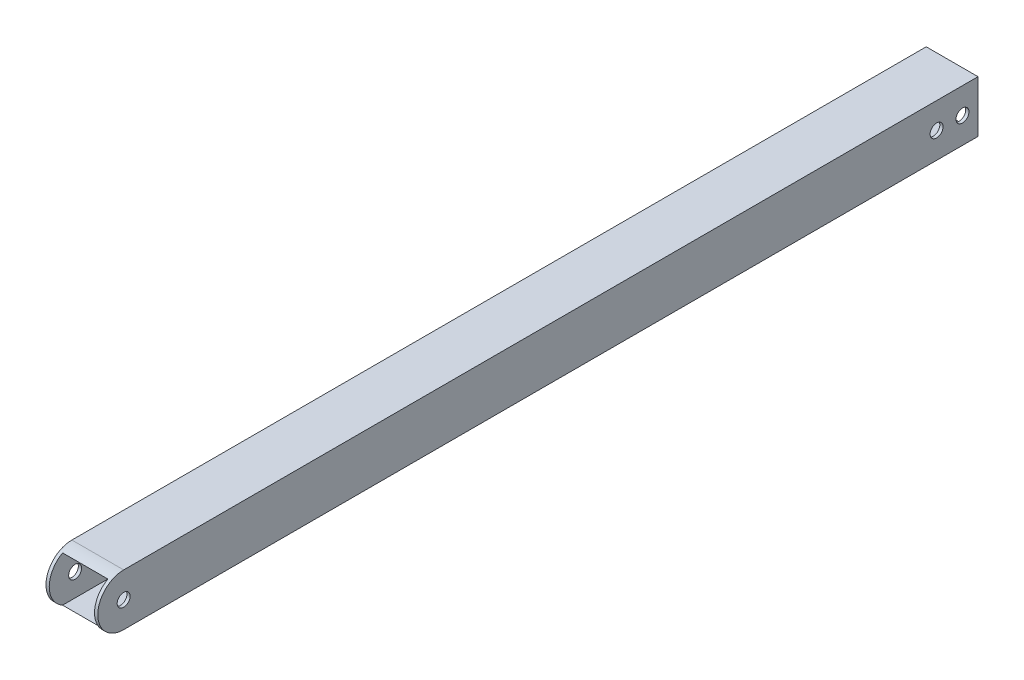
ISO-10303-21;
HEADER;
FILE_DESCRIPTION(('STEP AP214'),'2;1');
FILE_NAME('part.step','',(''),(''),'','','');
FILE_SCHEMA(('AUTOMOTIVE_DESIGN { 1 0 10303 214 1 1 1 1 }'));
ENDSEC;
DATA;
#1=APPLICATION_CONTEXT('core data for automotive mechanical design processes');
#2=APPLICATION_PROTOCOL_DEFINITION('international standard','automotive_design',2000,#1);
#3=PRODUCT_CONTEXT('',#1,'mechanical');
#4=PRODUCT('Part','Part','',(#3));
#5=PRODUCT_RELATED_PRODUCT_CATEGORY('part','',(#4));
#6=PRODUCT_DEFINITION_FORMATION('','',#4);
#7=PRODUCT_DEFINITION_CONTEXT('part definition',#1,'design');
#8=PRODUCT_DEFINITION('design','',#6,#7);
#9=PRODUCT_DEFINITION_SHAPE('','',#8);
#10=(LENGTH_UNIT() NAMED_UNIT(*) SI_UNIT(.MILLI.,.METRE.));
#11=(NAMED_UNIT(*) PLANE_ANGLE_UNIT() SI_UNIT($,.RADIAN.));
#12=(NAMED_UNIT(*) SI_UNIT($,.STERADIAN.) SOLID_ANGLE_UNIT());
#13=UNCERTAINTY_MEASURE_WITH_UNIT(LENGTH_MEASURE(1.E-05),#10,'distance_accuracy_value','');
#14=(GEOMETRIC_REPRESENTATION_CONTEXT(3) GLOBAL_UNCERTAINTY_ASSIGNED_CONTEXT((#13)) GLOBAL_UNIT_ASSIGNED_CONTEXT((#10,
#11,#12)) REPRESENTATION_CONTEXT('',''));
#15=CARTESIAN_POINT('',(0.,0.,0.));
#16=DIRECTION('',(0.,0.,1.));
#17=DIRECTION('',(1.,0.,0.));
#18=AXIS2_PLACEMENT_3D('',#15,#16,#17);
#19=CARTESIAN_POINT('',(12.7,12.7,431.8));
#20=DIRECTION('',(-1.,0.,0.));
#21=DIRECTION('',(0.,-1.,0.));
#22=AXIS2_PLACEMENT_3D('',#19,#20,#21);
#23=PLANE('',#22);
#24=CARTESIAN_POINT('',(12.7,0.,419.1));
#25=DIRECTION('',(1.,0.,0.));
#26=DIRECTION('',(0.,1.,0.));
#27=AXIS2_PLACEMENT_3D('',#24,#25,#26);
#28=CIRCLE('',#27,3.17499999999997);
#29=CARTESIAN_POINT('',(12.7,3.17499999999997,419.1));
#30=VERTEX_POINT('',#29);
#31=EDGE_CURVE('E205',#30,#30,#28,.T.);
#32=ORIENTED_EDGE('',*,*,#31,.F.);
#33=EDGE_LOOP('',(#32));
#34=FACE_BOUND('',#33,.T.);
#35=CARTESIAN_POINT('',(12.7,0.,7.62));
#36=DIRECTION('',(1.,0.,0.));
#37=DIRECTION('',(0.,1.,0.));
#38=AXIS2_PLACEMENT_3D('',#35,#36,#37);
#39=CIRCLE('',#38,3.175);
#40=CARTESIAN_POINT('',(12.7,3.175,7.62));
#41=VERTEX_POINT('',#40);
#42=EDGE_CURVE('E211',#41,#41,#39,.T.);
#43=ORIENTED_EDGE('',*,*,#42,.F.);
#44=EDGE_LOOP('',(#43));
#45=FACE_BOUND('',#44,.T.);
#46=CARTESIAN_POINT('',(12.7,0.,20.32));
#47=DIRECTION('',(1.,0.,0.));
#48=DIRECTION('',(0.,1.,0.));
#49=AXIS2_PLACEMENT_3D('',#46,#47,#48);
#50=CIRCLE('',#49,3.175);
#51=CARTESIAN_POINT('',(12.7,3.175,20.32));
#52=VERTEX_POINT('',#51);
#53=EDGE_CURVE('E202',#52,#52,#50,.T.);
#54=ORIENTED_EDGE('',*,*,#53,.F.);
#55=EDGE_LOOP('',(#54));
#56=FACE_BOUND('',#55,.T.);
#57=CARTESIAN_POINT('',(12.7,0.,419.1));
#58=DIRECTION('',(1.,0.,0.));
#59=DIRECTION('',(0.,1.,0.));
#60=AXIS2_PLACEMENT_3D('',#57,#58,#59);
#61=CIRCLE('',#60,12.7);
#62=CARTESIAN_POINT('',(12.7,12.7,419.1));
#63=VERTEX_POINT('',#62);
#64=CARTESIAN_POINT('',(12.7,-12.7,419.1));
#65=VERTEX_POINT('',#64);
#66=EDGE_CURVE('E116',#63,#65,#61,.T.);
#67=ORIENTED_EDGE('',*,*,#66,.T.);
#68=DIRECTION('',(0.,0.,-1.));
#69=VECTOR('',#68,1.);
#70=CARTESIAN_POINT('',(12.7,-12.7,431.8));
#71=LINE('',#70,#69);
#72=CARTESIAN_POINT('',(12.7,-12.7,0.));
#73=VERTEX_POINT('',#72);
#74=EDGE_CURVE('E120',#65,#73,#71,.T.);
#75=ORIENTED_EDGE('',*,*,#74,.T.);
#76=DIRECTION('',(0.,1.,0.));
#77=VECTOR('',#76,1.);
#78=CARTESIAN_POINT('',(12.7,12.7,0.));
#79=LINE('',#78,#77);
#80=CARTESIAN_POINT('',(12.7,12.7,0.));
#81=VERTEX_POINT('',#80);
#82=EDGE_CURVE('E181',#73,#81,#79,.T.);
#83=ORIENTED_EDGE('',*,*,#82,.T.);
#84=DIRECTION('',(0.,0.,-1.));
#85=VECTOR('',#84,1.);
#86=CARTESIAN_POINT('',(12.7,12.7,431.8));
#87=LINE('',#86,#85);
#88=EDGE_CURVE('E122',#63,#81,#87,.T.);
#89=ORIENTED_EDGE('',*,*,#88,.F.);
#90=EDGE_LOOP('',(#67,#75,#83,#89));
#91=FACE_BOUND('',#90,.T.);
#92=ADVANCED_FACE('F52',(#34,#45,#56,#91),#23,.F.);
#93=CARTESIAN_POINT('',(-12.7,12.7,431.8));
#94=DIRECTION('',(1.,0.,0.));
#95=DIRECTION('',(0.,1.,0.));
#96=AXIS2_PLACEMENT_3D('',#93,#94,#95);
#97=PLANE('',#96);
#98=CARTESIAN_POINT('',(-12.7,0.,419.1));
#99=DIRECTION('',(1.,0.,0.));
#100=DIRECTION('',(0.,1.,0.));
#101=AXIS2_PLACEMENT_3D('',#98,#99,#100);
#102=CIRCLE('',#101,3.17499999999997);
#103=CARTESIAN_POINT('',(-12.7,3.17499999999997,419.1));
#104=VERTEX_POINT('',#103);
#105=EDGE_CURVE('E153',#104,#104,#102,.T.);
#106=ORIENTED_EDGE('',*,*,#105,.T.);
#107=EDGE_LOOP('',(#106));
#108=FACE_BOUND('',#107,.T.);
#109=CARTESIAN_POINT('',(-12.7,0.,7.62));
#110=DIRECTION('',(1.,0.,0.));
#111=DIRECTION('',(0.,1.,0.));
#112=AXIS2_PLACEMENT_3D('',#109,#110,#111);
#113=CIRCLE('',#112,3.175);
#114=CARTESIAN_POINT('',(-12.7,3.175,7.62));
#115=VERTEX_POINT('',#114);
#116=EDGE_CURVE('E208',#115,#115,#113,.T.);
#117=ORIENTED_EDGE('',*,*,#116,.T.);
#118=EDGE_LOOP('',(#117));
#119=FACE_BOUND('',#118,.T.);
#120=CARTESIAN_POINT('',(-12.7,0.,20.32));
#121=DIRECTION('',(1.,0.,0.));
#122=DIRECTION('',(0.,1.,0.));
#123=AXIS2_PLACEMENT_3D('',#120,#121,#122);
#124=CIRCLE('',#123,3.175);
#125=CARTESIAN_POINT('',(-12.7,3.175,20.32));
#126=VERTEX_POINT('',#125);
#127=EDGE_CURVE('E214',#126,#126,#124,.T.);
#128=ORIENTED_EDGE('',*,*,#127,.T.);
#129=EDGE_LOOP('',(#128));
#130=FACE_BOUND('',#129,.T.);
#131=DIRECTION('',(0.,0.,-1.));
#132=VECTOR('',#131,1.);
#133=CARTESIAN_POINT('',(-12.7,-12.7,431.8));
#134=LINE('',#133,#132);
#135=CARTESIAN_POINT('',(-12.7000000000002,-12.7,419.1));
#136=VERTEX_POINT('',#135);
#137=CARTESIAN_POINT('',(-12.7,-12.7,0.));
#138=VERTEX_POINT('',#137);
#139=EDGE_CURVE('E139',#136,#138,#134,.T.);
#140=ORIENTED_EDGE('',*,*,#139,.F.);
#141=CARTESIAN_POINT('',(-12.7,0.,419.1));
#142=DIRECTION('',(1.,0.,0.));
#143=DIRECTION('',(0.,1.,0.));
#144=AXIS2_PLACEMENT_3D('',#141,#142,#143);
#145=CIRCLE('',#144,12.7);
#146=CARTESIAN_POINT('',(-12.7000000000001,12.7,419.1));
#147=VERTEX_POINT('',#146);
#148=EDGE_CURVE('E131',#147,#136,#145,.T.);
#149=ORIENTED_EDGE('',*,*,#148,.F.);
#150=DIRECTION('',(0.,0.,-1.));
#151=VECTOR('',#150,1.);
#152=CARTESIAN_POINT('',(-12.7,12.7,431.8));
#153=LINE('',#152,#151);
#154=CARTESIAN_POINT('',(-12.7,12.7,0.));
#155=VERTEX_POINT('',#154);
#156=EDGE_CURVE('E141',#147,#155,#153,.T.);
#157=ORIENTED_EDGE('',*,*,#156,.T.);
#158=DIRECTION('',(0.,-1.,0.));
#159=VECTOR('',#158,1.);
#160=CARTESIAN_POINT('',(-12.7,12.7,0.));
#161=LINE('',#160,#159);
#162=EDGE_CURVE('E143',#155,#138,#161,.T.);
#163=ORIENTED_EDGE('',*,*,#162,.T.);
#164=EDGE_LOOP('',(#140,#149,#157,#163));
#165=FACE_BOUND('',#164,.T.);
#166=ADVANCED_FACE('F188',(#108,#119,#130,#165),#97,.F.);
#167=CARTESIAN_POINT('',(-11.1125,11.1125,431.8));
#168=DIRECTION('',(1.,0.,0.));
#169=DIRECTION('',(0.,1.,0.));
#170=AXIS2_PLACEMENT_3D('',#167,#168,#169);
#171=PLANE('',#170);
#172=CARTESIAN_POINT('',(-11.1125,0.,419.1));
#173=DIRECTION('',(1.,0.,0.));
#174=DIRECTION('',(0.,1.,0.));
#175=AXIS2_PLACEMENT_3D('',#172,#173,#174);
#176=CIRCLE('',#175,3.17499999999997);
#177=CARTESIAN_POINT('',(-11.1125,3.17499999999997,419.1));
#178=VERTEX_POINT('',#177);
#179=EDGE_CURVE('E160',#178,#178,#176,.T.);
#180=ORIENTED_EDGE('',*,*,#179,.F.);
#181=EDGE_LOOP('',(#180));
#182=FACE_BOUND('',#181,.T.);
#183=CARTESIAN_POINT('',(-11.1125,0.,7.62));
#184=DIRECTION('',(1.,0.,0.));
#185=DIRECTION('',(0.,1.,0.));
#186=AXIS2_PLACEMENT_3D('',#183,#184,#185);
#187=CIRCLE('',#186,3.175);
#188=CARTESIAN_POINT('',(-11.1125,3.175,7.62));
#189=VERTEX_POINT('',#188);
#190=EDGE_CURVE('E157',#189,#189,#187,.T.);
#191=ORIENTED_EDGE('',*,*,#190,.F.);
#192=EDGE_LOOP('',(#191));
#193=FACE_BOUND('',#192,.T.);
#194=CARTESIAN_POINT('',(-11.1125,0.,20.32));
#195=DIRECTION('',(1.,0.,0.));
#196=DIRECTION('',(0.,1.,0.));
#197=AXIS2_PLACEMENT_3D('',#194,#195,#196);
#198=CIRCLE('',#197,3.175);
#199=CARTESIAN_POINT('',(-11.1125,3.175,20.32));
#200=VERTEX_POINT('',#199);
#201=EDGE_CURVE('E152',#200,#200,#198,.T.);
#202=ORIENTED_EDGE('',*,*,#201,.F.);
#203=EDGE_LOOP('',(#202));
#204=FACE_BOUND('',#203,.T.);
#205=CARTESIAN_POINT('',(-11.1125,0.,419.1));
#206=DIRECTION('',(1.,0.,0.));
#207=DIRECTION('',(0.,1.,0.));
#208=AXIS2_PLACEMENT_3D('',#205,#206,#207);
#209=CIRCLE('',#208,12.7);
#210=CARTESIAN_POINT('',(-11.1125,11.1125,425.248361062104));
#211=VERTEX_POINT('',#210);
#212=CARTESIAN_POINT('',(-11.1125,-11.1124999999999,425.248361062104));
#213=VERTEX_POINT('',#212);
#214=EDGE_CURVE('E66',#211,#213,#209,.T.);
#215=ORIENTED_EDGE('',*,*,#214,.T.);
#216=DIRECTION('',(0.,0.,-1.));
#217=VECTOR('',#216,1.);
#218=CARTESIAN_POINT('',(-11.1125,-11.1125,431.8));
#219=LINE('',#218,#217);
#220=CARTESIAN_POINT('',(-11.1125,-11.1125,0.));
#221=VERTEX_POINT('',#220);
#222=EDGE_CURVE('E179',#213,#221,#219,.T.);
#223=ORIENTED_EDGE('',*,*,#222,.T.);
#224=DIRECTION('',(0.,-1.,0.));
#225=VECTOR('',#224,1.);
#226=CARTESIAN_POINT('',(-11.1125,11.1125,0.));
#227=LINE('',#226,#225);
#228=CARTESIAN_POINT('',(-11.1125,11.1125,0.));
#229=VERTEX_POINT('',#228);
#230=EDGE_CURVE('E168',#229,#221,#227,.T.);
#231=ORIENTED_EDGE('',*,*,#230,.F.);
#232=DIRECTION('',(0.,0.,-1.));
#233=VECTOR('',#232,1.);
#234=CARTESIAN_POINT('',(-11.1125,11.1125,431.8));
#235=LINE('',#234,#233);
#236=EDGE_CURVE('E73',#211,#229,#235,.T.);
#237=ORIENTED_EDGE('',*,*,#236,.F.);
#238=EDGE_LOOP('',(#215,#223,#231,#237));
#239=FACE_BOUND('',#238,.T.);
#240=ADVANCED_FACE('F166',(#182,#193,#204,#239),#171,.T.);
#241=CARTESIAN_POINT('',(11.1125,11.1125,431.8));
#242=DIRECTION('',(-1.,0.,0.));
#243=DIRECTION('',(0.,-1.,0.));
#244=AXIS2_PLACEMENT_3D('',#241,#242,#243);
#245=PLANE('',#244);
#246=CARTESIAN_POINT('',(11.1125,0.,419.1));
#247=DIRECTION('',(-1.,0.,0.));
#248=DIRECTION('',(0.,-1.,0.));
#249=AXIS2_PLACEMENT_3D('',#246,#247,#248);
#250=CIRCLE('',#249,3.17499999999997);
#251=CARTESIAN_POINT('',(11.1125,-3.17499999999997,419.1));
#252=VERTEX_POINT('',#251);
#253=EDGE_CURVE('E158',#252,#252,#250,.T.);
#254=ORIENTED_EDGE('',*,*,#253,.F.);
#255=EDGE_LOOP('',(#254));
#256=FACE_BOUND('',#255,.T.);
#257=CARTESIAN_POINT('',(11.1125,0.,7.62));
#258=DIRECTION('',(-1.,0.,0.));
#259=DIRECTION('',(0.,-1.,0.));
#260=AXIS2_PLACEMENT_3D('',#257,#258,#259);
#261=CIRCLE('',#260,3.175);
#262=CARTESIAN_POINT('',(11.1125,-3.175,7.62));
#263=VERTEX_POINT('',#262);
#264=EDGE_CURVE('E154',#263,#263,#261,.T.);
#265=ORIENTED_EDGE('',*,*,#264,.F.);
#266=EDGE_LOOP('',(#265));
#267=FACE_BOUND('',#266,.T.);
#268=CARTESIAN_POINT('',(11.1125,0.,20.32));
#269=DIRECTION('',(-1.,0.,0.));
#270=DIRECTION('',(0.,-1.,0.));
#271=AXIS2_PLACEMENT_3D('',#268,#269,#270);
#272=CIRCLE('',#271,3.175);
#273=CARTESIAN_POINT('',(11.1125,-3.175,20.32));
#274=VERTEX_POINT('',#273);
#275=EDGE_CURVE('E149',#274,#274,#272,.T.);
#276=ORIENTED_EDGE('',*,*,#275,.F.);
#277=EDGE_LOOP('',(#276));
#278=FACE_BOUND('',#277,.T.);
#279=DIRECTION('',(0.,0.,-1.));
#280=VECTOR('',#279,1.);
#281=CARTESIAN_POINT('',(11.1125,-11.1125,431.8));
#282=LINE('',#281,#280);
#283=CARTESIAN_POINT('',(11.1125,-11.1124999999999,425.248361062104));
#284=VERTEX_POINT('',#283);
#285=CARTESIAN_POINT('',(11.1125,-11.1125,0.));
#286=VERTEX_POINT('',#285);
#287=EDGE_CURVE('E172',#284,#286,#282,.T.);
#288=ORIENTED_EDGE('',*,*,#287,.F.);
#289=CARTESIAN_POINT('',(11.1125,0.,419.1));
#290=DIRECTION('',(-1.,0.,0.));
#291=DIRECTION('',(0.,-1.,0.));
#292=AXIS2_PLACEMENT_3D('',#289,#290,#291);
#293=CIRCLE('',#292,12.7);
#294=CARTESIAN_POINT('',(11.1125,11.1125000000001,425.248361062104));
#295=VERTEX_POINT('',#294);
#296=EDGE_CURVE('E196',#284,#295,#293,.T.);
#297=ORIENTED_EDGE('',*,*,#296,.T.);
#298=DIRECTION('',(0.,0.,-1.));
#299=VECTOR('',#298,1.);
#300=CARTESIAN_POINT('',(11.1125,11.1125,431.8));
#301=LINE('',#300,#299);
#302=CARTESIAN_POINT('',(11.1125,11.1125,0.));
#303=VERTEX_POINT('',#302);
#304=EDGE_CURVE('E163',#295,#303,#301,.T.);
#305=ORIENTED_EDGE('',*,*,#304,.T.);
#306=DIRECTION('',(0.,1.,0.));
#307=VECTOR('',#306,1.);
#308=CARTESIAN_POINT('',(11.1125,11.1125,0.));
#309=LINE('',#308,#307);
#310=EDGE_CURVE('E174',#286,#303,#309,.T.);
#311=ORIENTED_EDGE('',*,*,#310,.F.);
#312=EDGE_LOOP('',(#288,#297,#305,#311));
#313=FACE_BOUND('',#312,.T.);
#314=ADVANCED_FACE('F233',(#256,#267,#278,#313),#245,.T.);
#315=CARTESIAN_POINT('',(-12.7,-12.7,431.8));
#316=DIRECTION('',(0.,1.,0.));
#317=DIRECTION('',(0.,0.,1.));
#318=AXIS2_PLACEMENT_3D('',#315,#316,#317);
#319=PLANE('',#318);
#320=DIRECTION('',(1.,0.,0.));
#321=VECTOR('',#320,1.);
#322=CARTESIAN_POINT('',(-478.79,-12.7000000000001,419.1));
#323=LINE('',#322,#321);
#324=EDGE_CURVE('E126',#136,#65,#323,.T.);
#325=ORIENTED_EDGE('',*,*,#324,.F.);
#326=ORIENTED_EDGE('',*,*,#139,.T.);
#327=DIRECTION('',(1.,0.,0.));
#328=VECTOR('',#327,1.);
#329=CARTESIAN_POINT('',(-12.7,-12.7,0.));
#330=LINE('',#329,#328);
#331=EDGE_CURVE('E137',#138,#73,#330,.T.);
#332=ORIENTED_EDGE('',*,*,#331,.T.);
#333=ORIENTED_EDGE('',*,*,#74,.F.);
#334=EDGE_LOOP('',(#325,#326,#332,#333));
#335=FACE_BOUND('',#334,.T.);
#336=ADVANCED_FACE('F135',(#335),#319,.F.);
#337=CARTESIAN_POINT('',(-11.1125,-11.1125,431.8));
#338=DIRECTION('',(0.,1.,0.));
#339=DIRECTION('',(0.,0.,1.));
#340=AXIS2_PLACEMENT_3D('',#337,#338,#339);
#341=PLANE('',#340);
#342=ORIENTED_EDGE('',*,*,#222,.F.);
#343=DIRECTION('',(1.,0.,0.));
#344=VECTOR('',#343,1.);
#345=CARTESIAN_POINT('',(-478.79,-11.1125,425.248361062104));
#346=LINE('',#345,#344);
#347=EDGE_CURVE('E12',#213,#284,#346,.T.);
#348=ORIENTED_EDGE('',*,*,#347,.T.);
#349=ORIENTED_EDGE('',*,*,#287,.T.);
#350=DIRECTION('',(1.,0.,0.));
#351=VECTOR('',#350,1.);
#352=CARTESIAN_POINT('',(-11.1125,-11.1125,0.));
#353=LINE('',#352,#351);
#354=EDGE_CURVE('E226',#221,#286,#353,.T.);
#355=ORIENTED_EDGE('',*,*,#354,.F.);
#356=EDGE_LOOP('',(#342,#348,#349,#355));
#357=FACE_BOUND('',#356,.T.);
#358=ADVANCED_FACE('F236',(#357),#341,.T.);
#359=CARTESIAN_POINT('',(-11.1125,11.1125,431.8));
#360=DIRECTION('',(0.,-1.,0.));
#361=DIRECTION('',(0.,0.,-1.));
#362=AXIS2_PLACEMENT_3D('',#359,#360,#361);
#363=PLANE('',#362);
#364=ORIENTED_EDGE('',*,*,#304,.F.);
#365=DIRECTION('',(1.,0.,0.));
#366=VECTOR('',#365,1.);
#367=CARTESIAN_POINT('',(-478.79,11.1125,425.248361062104));
#368=LINE('',#367,#366);
#369=EDGE_CURVE('E59',#295,#211,#368,.F.);
#370=ORIENTED_EDGE('',*,*,#369,.T.);
#371=ORIENTED_EDGE('',*,*,#236,.T.);
#372=DIRECTION('',(-1.,0.,0.));
#373=VECTOR('',#372,1.);
#374=CARTESIAN_POINT('',(-11.1125,11.1125,0.));
#375=LINE('',#374,#373);
#376=EDGE_CURVE('E170',#303,#229,#375,.T.);
#377=ORIENTED_EDGE('',*,*,#376,.F.);
#378=EDGE_LOOP('',(#364,#370,#371,#377));
#379=FACE_BOUND('',#378,.T.);
#380=ADVANCED_FACE('F162',(#379),#363,.T.);
#381=CARTESIAN_POINT('',(0.,0.,0.));
#382=DIRECTION('',(0.,0.,1.));
#383=DIRECTION('',(1.,0.,0.));
#384=AXIS2_PLACEMENT_3D('',#381,#382,#383);
#385=PLANE('',#384);
#386=ORIENTED_EDGE('',*,*,#82,.F.);
#387=ORIENTED_EDGE('',*,*,#331,.F.);
#388=ORIENTED_EDGE('',*,*,#162,.F.);
#389=DIRECTION('',(-1.,0.,0.));
#390=VECTOR('',#389,1.);
#391=CARTESIAN_POINT('',(-12.7,12.7,0.));
#392=LINE('',#391,#390);
#393=EDGE_CURVE('E183',#81,#155,#392,.T.);
#394=ORIENTED_EDGE('',*,*,#393,.F.);
#395=EDGE_LOOP('',(#386,#387,#388,#394));
#396=FACE_BOUND('',#395,.T.);
#397=ORIENTED_EDGE('',*,*,#230,.T.);
#398=ORIENTED_EDGE('',*,*,#354,.T.);
#399=ORIENTED_EDGE('',*,*,#310,.T.);
#400=ORIENTED_EDGE('',*,*,#376,.T.);
#401=EDGE_LOOP('',(#397,#398,#399,#400));
#402=FACE_BOUND('',#401,.T.);
#403=ADVANCED_FACE('F192',(#396,#402),#385,.F.);
#404=CARTESIAN_POINT('',(-12.7,12.7,431.8));
#405=DIRECTION('',(0.,-1.,0.));
#406=DIRECTION('',(0.,0.,-1.));
#407=AXIS2_PLACEMENT_3D('',#404,#405,#406);
#408=PLANE('',#407);
#409=ORIENTED_EDGE('',*,*,#156,.F.);
#410=DIRECTION('',(1.,0.,0.));
#411=VECTOR('',#410,1.);
#412=CARTESIAN_POINT('',(-478.79,12.6999999999999,419.1));
#413=LINE('',#412,#411);
#414=EDGE_CURVE('E125',#147,#63,#413,.T.);
#415=ORIENTED_EDGE('',*,*,#414,.T.);
#416=ORIENTED_EDGE('',*,*,#88,.T.);
#417=ORIENTED_EDGE('',*,*,#393,.T.);
#418=EDGE_LOOP('',(#409,#415,#416,#417));
#419=FACE_BOUND('',#418,.T.);
#420=ADVANCED_FACE('F195',(#419),#408,.F.);
#421=CARTESIAN_POINT('',(-12.7,0.,20.32));
#422=DIRECTION('',(1.,0.,0.));
#423=DIRECTION('',(0.,1.,0.));
#424=AXIS2_PLACEMENT_3D('',#421,#422,#423);
#425=CYLINDRICAL_SURFACE('',#424,3.175);
#426=ORIENTED_EDGE('',*,*,#275,.T.);
#427=EDGE_LOOP('',(#426));
#428=FACE_BOUND('',#427,.T.);
#429=ORIENTED_EDGE('',*,*,#53,.T.);
#430=EDGE_LOOP('',(#429));
#431=FACE_BOUND('',#430,.T.);
#432=ADVANCED_FACE('F260',(#428,#431),#425,.F.);
#433=CARTESIAN_POINT('',(-12.7,0.,7.62));
#434=DIRECTION('',(1.,0.,0.));
#435=DIRECTION('',(0.,1.,0.));
#436=AXIS2_PLACEMENT_3D('',#433,#434,#435);
#437=CYLINDRICAL_SURFACE('',#436,3.175);
#438=ORIENTED_EDGE('',*,*,#264,.T.);
#439=EDGE_LOOP('',(#438));
#440=FACE_BOUND('',#439,.T.);
#441=ORIENTED_EDGE('',*,*,#42,.T.);
#442=EDGE_LOOP('',(#441));
#443=FACE_BOUND('',#442,.T.);
#444=ADVANCED_FACE('F262',(#440,#443),#437,.F.);
#445=CARTESIAN_POINT('',(-12.7,0.,419.1));
#446=DIRECTION('',(1.,0.,0.));
#447=DIRECTION('',(0.,1.,0.));
#448=AXIS2_PLACEMENT_3D('',#445,#446,#447);
#449=CYLINDRICAL_SURFACE('',#448,3.17499999999997);
#450=ORIENTED_EDGE('',*,*,#253,.T.);
#451=EDGE_LOOP('',(#450));
#452=FACE_BOUND('',#451,.T.);
#453=ORIENTED_EDGE('',*,*,#31,.T.);
#454=EDGE_LOOP('',(#453));
#455=FACE_BOUND('',#454,.T.);
#456=ADVANCED_FACE('F270',(#452,#455),#449,.F.);
#457=ORIENTED_EDGE('',*,*,#201,.T.);
#458=EDGE_LOOP('',(#457));
#459=FACE_BOUND('',#458,.T.);
#460=ORIENTED_EDGE('',*,*,#127,.F.);
#461=EDGE_LOOP('',(#460));
#462=FACE_BOUND('',#461,.T.);
#463=ADVANCED_FACE('F265',(#459,#462),#425,.F.);
#464=ORIENTED_EDGE('',*,*,#190,.T.);
#465=EDGE_LOOP('',(#464));
#466=FACE_BOUND('',#465,.T.);
#467=ORIENTED_EDGE('',*,*,#116,.F.);
#468=EDGE_LOOP('',(#467));
#469=FACE_BOUND('',#468,.T.);
#470=ADVANCED_FACE('F273',(#466,#469),#437,.F.);
#471=ORIENTED_EDGE('',*,*,#179,.T.);
#472=EDGE_LOOP('',(#471));
#473=FACE_BOUND('',#472,.T.);
#474=ORIENTED_EDGE('',*,*,#105,.F.);
#475=EDGE_LOOP('',(#474));
#476=FACE_BOUND('',#475,.T.);
#477=ADVANCED_FACE('F280',(#473,#476),#449,.F.);
#478=CARTESIAN_POINT('',(-478.79,0.,419.1));
#479=DIRECTION('',(1.,0.,0.));
#480=DIRECTION('',(0.,1.,0.));
#481=AXIS2_PLACEMENT_3D('',#478,#479,#480);
#482=CYLINDRICAL_SURFACE('',#481,12.7);
#483=ORIENTED_EDGE('',*,*,#324,.T.);
#484=ORIENTED_EDGE('',*,*,#66,.F.);
#485=ORIENTED_EDGE('',*,*,#414,.F.);
#486=ORIENTED_EDGE('',*,*,#148,.T.);
#487=EDGE_LOOP('',(#483,#484,#485,#486));
#488=FACE_BOUND('',#487,.T.);
#489=ORIENTED_EDGE('',*,*,#296,.F.);
#490=ORIENTED_EDGE('',*,*,#347,.F.);
#491=ORIENTED_EDGE('',*,*,#214,.F.);
#492=ORIENTED_EDGE('',*,*,#369,.F.);
#493=EDGE_LOOP('',(#489,#490,#491,#492));
#494=FACE_BOUND('',#493,.T.);
#495=ADVANCED_FACE('F129',(#488,#494),#482,.T.);
#496=CLOSED_SHELL('',(#92,#166,#240,#314,#336,#358,#380,#403,#420,#432,#444,#456,#463,#470,#477,#495));
#497=MANIFOLD_SOLID_BREP('B2',#496);
#498=ADVANCED_BREP_SHAPE_REPRESENTATION('',(#18,#497),#14);
#499=SHAPE_DEFINITION_REPRESENTATION(#9,#498);
ENDSEC;
END-ISO-10303-21;
